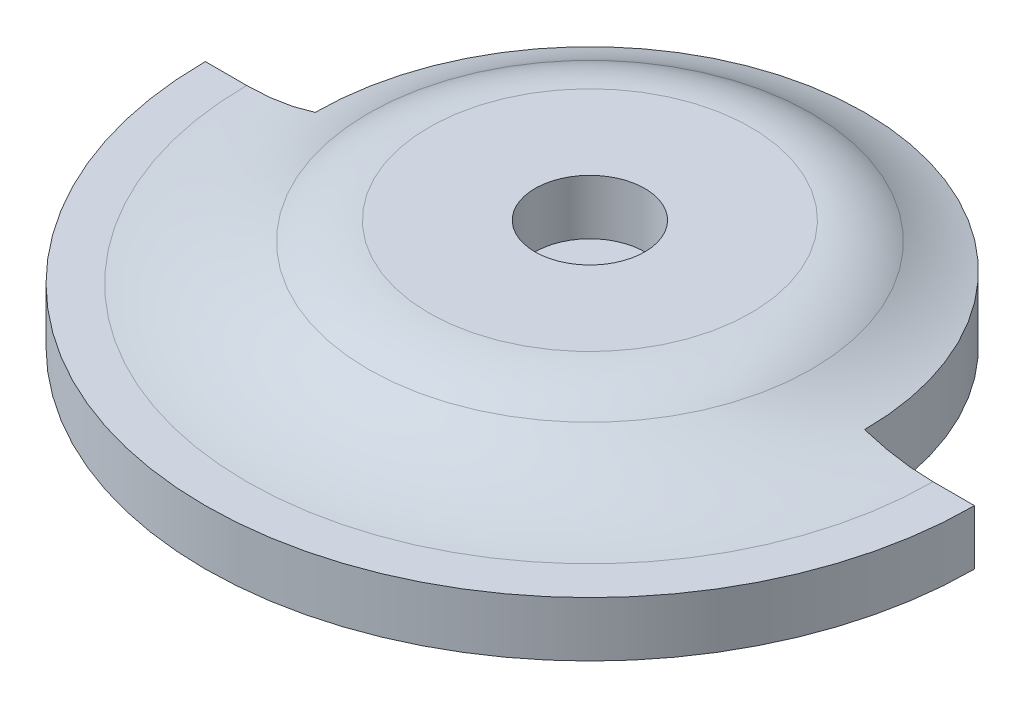
ISO-10303-21;
HEADER;
FILE_DESCRIPTION(('STEP AP214'),'2;1');
FILE_NAME('part.step','',(''),(''),'','','');
FILE_SCHEMA(('AUTOMOTIVE_DESIGN { 1 0 10303 214 1 1 1 1 }'));
ENDSEC;
DATA;
#1=APPLICATION_CONTEXT('core data for automotive mechanical design processes');
#2=APPLICATION_PROTOCOL_DEFINITION('international standard','automotive_design',2000,#1);
#3=PRODUCT_CONTEXT('',#1,'mechanical');
#4=PRODUCT('Part','Part','',(#3));
#5=PRODUCT_RELATED_PRODUCT_CATEGORY('part','',(#4));
#6=PRODUCT_DEFINITION_FORMATION('','',#4);
#7=PRODUCT_DEFINITION_CONTEXT('part definition',#1,'design');
#8=PRODUCT_DEFINITION('design','',#6,#7);
#9=PRODUCT_DEFINITION_SHAPE('','',#8);
#10=(LENGTH_UNIT() NAMED_UNIT(*) SI_UNIT(.MILLI.,.METRE.));
#11=(NAMED_UNIT(*) PLANE_ANGLE_UNIT() SI_UNIT($,.RADIAN.));
#12=(NAMED_UNIT(*) SI_UNIT($,.STERADIAN.) SOLID_ANGLE_UNIT());
#13=UNCERTAINTY_MEASURE_WITH_UNIT(LENGTH_MEASURE(1.E-05),#10,'distance_accuracy_value','');
#14=(GEOMETRIC_REPRESENTATION_CONTEXT(3) GLOBAL_UNCERTAINTY_ASSIGNED_CONTEXT((#13)) GLOBAL_UNIT_ASSIGNED_CONTEXT((#10,
#11,#12)) REPRESENTATION_CONTEXT('',''));
#15=CARTESIAN_POINT('',(0.,0.,0.));
#16=DIRECTION('',(0.,0.,1.));
#17=DIRECTION('',(1.,0.,0.));
#18=AXIS2_PLACEMENT_3D('',#15,#16,#17);
#19=CARTESIAN_POINT('',(0.,0.5,0.));
#20=DIRECTION('',(0.,-1.,0.));
#21=DIRECTION('',(0.,0.,-1.));
#22=AXIS2_PLACEMENT_3D('',#19,#20,#21);
#23=CYLINDRICAL_SURFACE('',#22,3.5);
#24=CARTESIAN_POINT('',(0.,0.,0.));
#25=DIRECTION('',(0.,1.,0.));
#26=DIRECTION('',(0.,0.,1.));
#27=AXIS2_PLACEMENT_3D('',#24,#25,#26);
#28=CIRCLE('',#27,3.5);
#29=CARTESIAN_POINT('',(-3.5,0.,0.));
#30=VERTEX_POINT('',#29);
#31=CARTESIAN_POINT('',(3.5,0.,0.));
#32=VERTEX_POINT('',#31);
#33=EDGE_CURVE('E103',#30,#32,#28,.T.);
#34=ORIENTED_EDGE('',*,*,#33,.T.);
#35=DIRECTION('',(0.,-1.,0.));
#36=VECTOR('',#35,1.);
#37=CARTESIAN_POINT('',(3.5,0.5,0.));
#38=LINE('',#37,#36);
#39=CARTESIAN_POINT('',(3.5,0.5,0.));
#40=VERTEX_POINT('',#39);
#41=EDGE_CURVE('E84',#40,#32,#38,.T.);
#42=ORIENTED_EDGE('',*,*,#41,.F.);
#43=CARTESIAN_POINT('',(0.,0.5,0.));
#44=DIRECTION('',(0.,1.,0.));
#45=DIRECTION('',(0.,0.,1.));
#46=AXIS2_PLACEMENT_3D('',#43,#44,#45);
#47=CIRCLE('',#46,3.5);
#48=CARTESIAN_POINT('',(-3.5,0.5,0.));
#49=VERTEX_POINT('',#48);
#50=EDGE_CURVE('E92',#49,#40,#47,.T.);
#51=ORIENTED_EDGE('',*,*,#50,.F.);
#52=DIRECTION('',(0.,-1.,0.));
#53=VECTOR('',#52,1.);
#54=CARTESIAN_POINT('',(-3.5,0.5,0.));
#55=LINE('',#54,#53);
#56=EDGE_CURVE('E169',#49,#30,#55,.T.);
#57=ORIENTED_EDGE('',*,*,#56,.T.);
#58=EDGE_LOOP('',(#34,#42,#51,#57));
#59=FACE_BOUND('',#58,.T.);
#60=ADVANCED_FACE('F34',(#59),#23,.T.);
#61=CARTESIAN_POINT('',(2.5,0.5,0.));
#62=DIRECTION('',(0.,0.,1.));
#63=DIRECTION('',(1.,0.,0.));
#64=AXIS2_PLACEMENT_3D('',#61,#62,#63);
#65=PLANE('',#64);
#66=DIRECTION('',(-1.,0.,0.));
#67=VECTOR('',#66,1.);
#68=CARTESIAN_POINT('',(2.5,0.,0.));
#69=LINE('',#68,#67);
#70=CARTESIAN_POINT('',(2.5,0.,0.));
#71=VERTEX_POINT('',#70);
#72=EDGE_CURVE('E171',#32,#71,#69,.T.);
#73=ORIENTED_EDGE('',*,*,#72,.T.);
#74=DIRECTION('',(0.,-1.,0.));
#75=VECTOR('',#74,1.);
#76=CARTESIAN_POINT('',(2.5,0.5,0.));
#77=LINE('',#76,#75);
#78=CARTESIAN_POINT('',(2.5,0.59946693852876,0.));
#79=VERTEX_POINT('',#78);
#80=EDGE_CURVE('E49',#79,#71,#77,.T.);
#81=ORIENTED_EDGE('',*,*,#80,.F.);
#82=CARTESIAN_POINT('',(3.12287565553229,2.5,0.));
#83=DIRECTION('',(0.,0.,1.));
#84=DIRECTION('',(1.,0.,0.));
#85=AXIS2_PLACEMENT_3D('',#82,#83,#84);
#86=CIRCLE('',#85,2.);
#87=CARTESIAN_POINT('',(3.12287565553229,0.5,0.));
#88=VERTEX_POINT('',#87);
#89=EDGE_CURVE('E87',#79,#88,#86,.T.);
#90=ORIENTED_EDGE('',*,*,#89,.T.);
#91=DIRECTION('',(-1.,0.,0.));
#92=VECTOR('',#91,1.);
#93=CARTESIAN_POINT('',(2.5,0.5,0.));
#94=LINE('',#93,#92);
#95=EDGE_CURVE('E80',#40,#88,#94,.T.);
#96=ORIENTED_EDGE('',*,*,#95,.F.);
#97=ORIENTED_EDGE('',*,*,#41,.T.);
#98=EDGE_LOOP('',(#73,#81,#90,#96,#97));
#99=FACE_BOUND('',#98,.T.);
#100=ADVANCED_FACE('F82',(#99),#65,.F.);
#101=CARTESIAN_POINT('',(0.,0.5,0.));
#102=DIRECTION('',(0.,-1.,0.));
#103=DIRECTION('',(0.,0.,-1.));
#104=AXIS2_PLACEMENT_3D('',#101,#102,#103);
#105=CYLINDRICAL_SURFACE('',#104,2.5);
#106=CARTESIAN_POINT('',(0.,0.,0.));
#107=DIRECTION('',(0.,1.,0.));
#108=DIRECTION('',(0.,0.,-1.));
#109=AXIS2_PLACEMENT_3D('',#106,#107,#108);
#110=CIRCLE('',#109,2.5);
#111=CARTESIAN_POINT('',(-2.5,0.,0.));
#112=VERTEX_POINT('',#111);
#113=EDGE_CURVE('E173',#71,#112,#110,.T.);
#114=ORIENTED_EDGE('',*,*,#113,.T.);
#115=DIRECTION('',(0.,-1.,0.));
#116=VECTOR('',#115,1.);
#117=CARTESIAN_POINT('',(-2.5,0.5,0.));
#118=LINE('',#117,#116);
#119=CARTESIAN_POINT('',(-2.5,0.59946693852876,0.));
#120=VERTEX_POINT('',#119);
#121=EDGE_CURVE('E56',#120,#112,#118,.T.);
#122=ORIENTED_EDGE('',*,*,#121,.F.);
#123=CARTESIAN_POINT('',(0.,0.59946693852876,0.));
#124=DIRECTION('',(0.,1.,0.));
#125=DIRECTION('',(0.,0.,1.));
#126=AXIS2_PLACEMENT_3D('',#123,#124,#125);
#127=CIRCLE('',#126,2.5);
#128=EDGE_CURVE('E112',#120,#79,#127,.F.);
#129=ORIENTED_EDGE('',*,*,#128,.T.);
#130=ORIENTED_EDGE('',*,*,#80,.T.);
#131=EDGE_LOOP('',(#114,#122,#129,#130));
#132=FACE_BOUND('',#131,.T.);
#133=ADVANCED_FACE('F134',(#132),#105,.T.);
#134=CARTESIAN_POINT('',(-3.5,0.5,0.));
#135=DIRECTION('',(0.,0.,1.));
#136=DIRECTION('',(1.,0.,0.));
#137=AXIS2_PLACEMENT_3D('',#134,#135,#136);
#138=PLANE('',#137);
#139=DIRECTION('',(-1.,0.,0.));
#140=VECTOR('',#139,1.);
#141=CARTESIAN_POINT('',(-3.5,0.,0.));
#142=LINE('',#141,#140);
#143=EDGE_CURVE('E100',#112,#30,#142,.T.);
#144=ORIENTED_EDGE('',*,*,#143,.T.);
#145=ORIENTED_EDGE('',*,*,#56,.F.);
#146=DIRECTION('',(-1.,0.,0.));
#147=VECTOR('',#146,1.);
#148=CARTESIAN_POINT('',(-3.5,0.5,0.));
#149=LINE('',#148,#147);
#150=CARTESIAN_POINT('',(-3.12287565553229,0.5,0.));
#151=VERTEX_POINT('',#150);
#152=EDGE_CURVE('E91',#151,#49,#149,.T.);
#153=ORIENTED_EDGE('',*,*,#152,.F.);
#154=CARTESIAN_POINT('',(-3.12287565553229,2.5,0.));
#155=DIRECTION('',(0.,0.,1.));
#156=DIRECTION('',(1.,0.,0.));
#157=AXIS2_PLACEMENT_3D('',#154,#155,#156);
#158=CIRCLE('',#157,2.);
#159=EDGE_CURVE('E106',#151,#120,#158,.T.);
#160=ORIENTED_EDGE('',*,*,#159,.T.);
#161=ORIENTED_EDGE('',*,*,#121,.T.);
#162=EDGE_LOOP('',(#144,#145,#153,#160,#161));
#163=FACE_BOUND('',#162,.T.);
#164=ADVANCED_FACE('F139',(#163),#138,.F.);
#165=CARTESIAN_POINT('',(0.,0.5,0.));
#166=DIRECTION('',(0.,1.,0.));
#167=DIRECTION('',(0.,0.,1.));
#168=AXIS2_PLACEMENT_3D('',#165,#166,#167);
#169=PLANE('',#168);
#170=ORIENTED_EDGE('',*,*,#95,.T.);
#171=CARTESIAN_POINT('',(0.,0.5,0.));
#172=DIRECTION('',(0.,1.,0.));
#173=DIRECTION('',(0.,0.,1.));
#174=AXIS2_PLACEMENT_3D('',#171,#172,#173);
#175=CIRCLE('',#174,3.12287565553229);
#176=EDGE_CURVE('E104',#88,#151,#175,.F.);
#177=ORIENTED_EDGE('',*,*,#176,.T.);
#178=ORIENTED_EDGE('',*,*,#152,.T.);
#179=ORIENTED_EDGE('',*,*,#50,.T.);
#180=EDGE_LOOP('',(#170,#177,#178,#179));
#181=FACE_BOUND('',#180,.T.);
#182=ADVANCED_FACE('F95',(#181),#169,.T.);
#183=CARTESIAN_POINT('',(0.,0.,0.));
#184=DIRECTION('',(0.,1.,0.));
#185=DIRECTION('',(0.,0.,1.));
#186=AXIS2_PLACEMENT_3D('',#183,#184,#185);
#187=PLANE('',#186);
#188=ORIENTED_EDGE('',*,*,#33,.F.);
#189=ORIENTED_EDGE('',*,*,#143,.F.);
#190=ORIENTED_EDGE('',*,*,#113,.F.);
#191=ORIENTED_EDGE('',*,*,#72,.F.);
#192=EDGE_LOOP('',(#188,#189,#190,#191));
#193=FACE_BOUND('',#192,.T.);
#194=ADVANCED_FACE('F143',(#193),#187,.F.);
#195=CARTESIAN_POINT('',(0.,1.,0.));
#196=DIRECTION('',(0.,1.,0.));
#197=DIRECTION('',(0.,0.,1.));
#198=AXIS2_PLACEMENT_3D('',#195,#196,#197);
#199=PLANE('',#198);
#200=CARTESIAN_POINT('',(0.,1.,0.));
#201=DIRECTION('',(0.,1.,0.));
#202=DIRECTION('',(0.,0.,1.));
#203=AXIS2_PLACEMENT_3D('',#200,#201,#202);
#204=CIRCLE('',#203,1.4645632603546);
#205=CARTESIAN_POINT('',(0.,1.,1.4645632603546));
#206=VERTEX_POINT('',#205);
#207=EDGE_CURVE('E42',#206,#206,#204,.T.);
#208=ORIENTED_EDGE('',*,*,#207,.T.);
#209=EDGE_LOOP('',(#208));
#210=FACE_BOUND('',#209,.T.);
#211=CARTESIAN_POINT('',(0.,1.,0.));
#212=DIRECTION('',(0.,1.,0.));
#213=DIRECTION('',(0.,0.,1.));
#214=AXIS2_PLACEMENT_3D('',#211,#212,#213);
#215=CIRCLE('',#214,0.5);
#216=CARTESIAN_POINT('',(0.,1.,0.5));
#217=VERTEX_POINT('',#216);
#218=EDGE_CURVE('E161',#217,#217,#215,.T.);
#219=ORIENTED_EDGE('',*,*,#218,.F.);
#220=EDGE_LOOP('',(#219));
#221=FACE_BOUND('',#220,.T.);
#222=ADVANCED_FACE('F117',(#210,#221),#199,.T.);
#223=CARTESIAN_POINT('',(0.,1.,0.));
#224=DIRECTION('',(0.,-1.,0.));
#225=DIRECTION('',(0.,0.,-1.));
#226=AXIS2_PLACEMENT_3D('',#223,#224,#225);
#227=CYLINDRICAL_SURFACE('',#226,0.5);
#228=ORIENTED_EDGE('',*,*,#218,.T.);
#229=EDGE_LOOP('',(#228));
#230=FACE_BOUND('',#229,.T.);
#231=CARTESIAN_POINT('',(0.,0.5,0.));
#232=DIRECTION('',(0.,1.,0.));
#233=DIRECTION('',(0.,0.,1.));
#234=AXIS2_PLACEMENT_3D('',#231,#232,#233);
#235=CIRCLE('',#234,0.5);
#236=CARTESIAN_POINT('',(0.,0.5,0.5));
#237=VERTEX_POINT('',#236);
#238=EDGE_CURVE('E164',#237,#237,#235,.T.);
#239=ORIENTED_EDGE('',*,*,#238,.F.);
#240=EDGE_LOOP('',(#239));
#241=FACE_BOUND('',#240,.T.);
#242=ADVANCED_FACE('F151',(#230,#241),#227,.F.);
#243=ORIENTED_EDGE('',*,*,#238,.T.);
#244=EDGE_LOOP('',(#243));
#245=FACE_BOUND('',#244,.T.);
#246=ADVANCED_FACE('F126',(#245),#169,.T.);
#247=CARTESIAN_POINT('',(0.,2.5,0.));
#248=DIRECTION('',(0.,1.,0.));
#249=DIRECTION('',(0.,0.,1.));
#250=AXIS2_PLACEMENT_3D('',#247,#248,#249);
#251=TOROIDAL_SURFACE('',#250,3.12287565553229,2.);
#252=CARTESIAN_POINT('',(0.,0.833333333333333,0.));
#253=DIRECTION('',(0.,1.,0.));
#254=DIRECTION('',(0.,0.,1.));
#255=AXIS2_PLACEMENT_3D('',#252,#253,#254);
#256=CIRCLE('',#255,2.01733405874716);
#257=CARTESIAN_POINT('',(0.,0.833333333333333,2.01733405874716));
#258=VERTEX_POINT('',#257);
#259=EDGE_CURVE('E11',#258,#258,#256,.F.);
#260=ORIENTED_EDGE('',*,*,#259,.T.);
#261=EDGE_LOOP('',(#260));
#262=FACE_BOUND('',#261,.T.);
#263=ORIENTED_EDGE('',*,*,#159,.F.);
#264=ORIENTED_EDGE('',*,*,#176,.F.);
#265=ORIENTED_EDGE('',*,*,#89,.F.);
#266=ORIENTED_EDGE('',*,*,#128,.F.);
#267=EDGE_LOOP('',(#263,#264,#265,#266));
#268=FACE_BOUND('',#267,.T.);
#269=ADVANCED_FACE('F121',(#262,#268),#251,.F.);
#270=CARTESIAN_POINT('',(0.,0.,0.));
#271=DIRECTION('',(0.,-1.,0.));
#272=DIRECTION('',(0.,0.,-1.));
#273=AXIS2_PLACEMENT_3D('',#270,#271,#272);
#274=TOROIDAL_SURFACE('',#273,1.4645632603546,1.);
#275=ORIENTED_EDGE('',*,*,#259,.F.);
#276=EDGE_LOOP('',(#275));
#277=FACE_BOUND('',#276,.T.);
#278=ORIENTED_EDGE('',*,*,#207,.F.);
#279=EDGE_LOOP('',(#278));
#280=FACE_BOUND('',#279,.T.);
#281=ADVANCED_FACE('F36',(#277,#280),#274,.T.);
#282=CLOSED_SHELL('',(#60,#100,#133,#164,#182,#194,#222,#242,#246,#269,#281));
#283=MANIFOLD_SOLID_BREP('B2',#282);
#284=ADVANCED_BREP_SHAPE_REPRESENTATION('',(#18,#283),#14);
#285=SHAPE_DEFINITION_REPRESENTATION(#9,#284);
ENDSEC;
END-ISO-10303-21;
